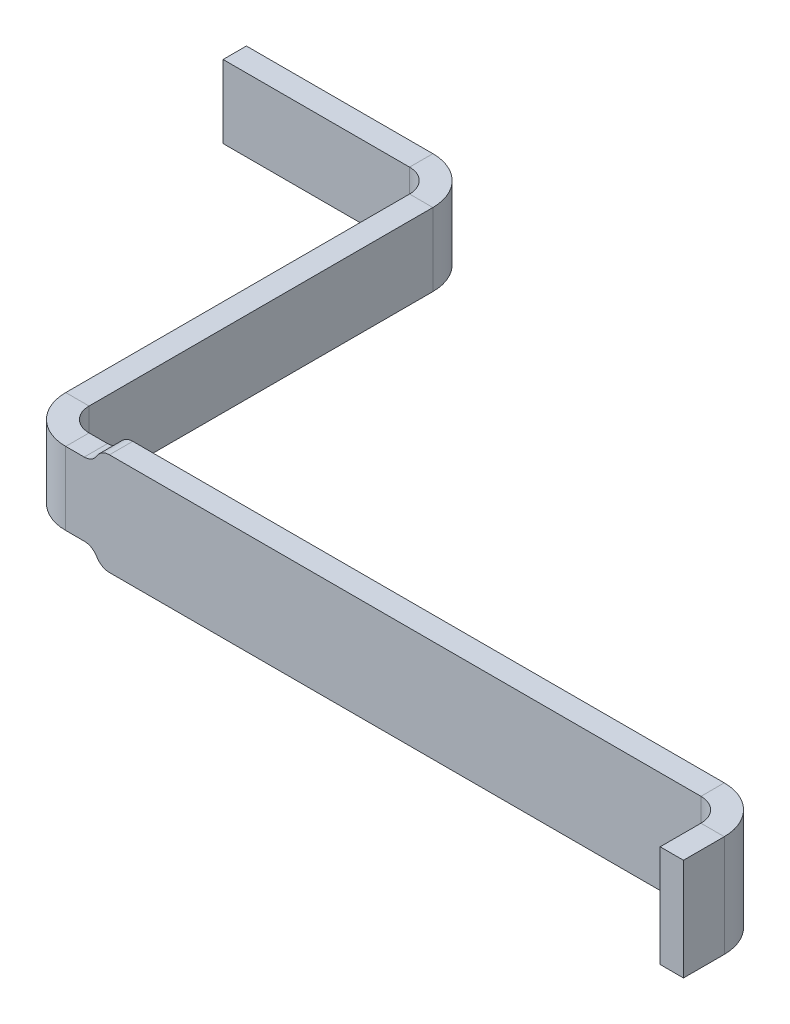
ISO-10303-21;
HEADER;
FILE_DESCRIPTION(('STEP AP214'),'2;1');
FILE_NAME('part.step','',(''),(''),'','','');
FILE_SCHEMA(('AUTOMOTIVE_DESIGN { 1 0 10303 214 1 1 1 1 }'));
ENDSEC;
DATA;
#1=APPLICATION_CONTEXT('core data for automotive mechanical design processes');
#2=APPLICATION_PROTOCOL_DEFINITION('international standard','automotive_design',2000,#1);
#3=PRODUCT_CONTEXT('',#1,'mechanical');
#4=PRODUCT('Part','Part','',(#3));
#5=PRODUCT_RELATED_PRODUCT_CATEGORY('part','',(#4));
#6=PRODUCT_DEFINITION_FORMATION('','',#4);
#7=PRODUCT_DEFINITION_CONTEXT('part definition',#1,'design');
#8=PRODUCT_DEFINITION('design','',#6,#7);
#9=PRODUCT_DEFINITION_SHAPE('','',#8);
#10=(LENGTH_UNIT() NAMED_UNIT(*) SI_UNIT(.MILLI.,.METRE.));
#11=(NAMED_UNIT(*) PLANE_ANGLE_UNIT() SI_UNIT($,.RADIAN.));
#12=(NAMED_UNIT(*) SI_UNIT($,.STERADIAN.) SOLID_ANGLE_UNIT());
#13=UNCERTAINTY_MEASURE_WITH_UNIT(LENGTH_MEASURE(1.E-05),#10,'distance_accuracy_value','');
#14=(GEOMETRIC_REPRESENTATION_CONTEXT(3) GLOBAL_UNCERTAINTY_ASSIGNED_CONTEXT((#13)) GLOBAL_UNIT_ASSIGNED_CONTEXT((#10,
#11,#12)) REPRESENTATION_CONTEXT('',''));
#15=CARTESIAN_POINT('',(0.,0.,0.));
#16=DIRECTION('',(0.,0.,1.));
#17=DIRECTION('',(1.,0.,0.));
#18=AXIS2_PLACEMENT_3D('',#15,#16,#17);
#19=CARTESIAN_POINT('',(0.05,0.,1.37));
#20=DIRECTION('',(0.,0.,-1.));
#21=DIRECTION('',(0.,-1.,0.));
#22=AXIS2_PLACEMENT_3D('',#19,#20,#21);
#23=PLANE('',#22);
#24=DIRECTION('',(-1.,0.,0.));
#25=VECTOR('',#24,1.);
#26=CARTESIAN_POINT('',(-0.463301270189222,0.125,1.37));
#27=LINE('',#26,#25);
#28=CARTESIAN_POINT('',(-0.976602540378444,0.125,1.37));
#29=VERTEX_POINT('',#28);
#30=CARTESIAN_POINT('',(-1.04,0.125,1.37));
#31=VERTEX_POINT('',#30);
#32=EDGE_CURVE('E474',#29,#31,#27,.T.);
#33=ORIENTED_EDGE('',*,*,#32,.T.);
#34=DIRECTION('',(0.,-1.,0.));
#35=VECTOR('',#34,1.);
#36=CARTESIAN_POINT('',(-1.04,-0.0875,1.37));
#37=LINE('',#36,#35);
#38=CARTESIAN_POINT('',(-1.04,-0.125,1.37));
#39=VERTEX_POINT('',#38);
#40=EDGE_CURVE('E319',#31,#39,#37,.T.);
#41=ORIENTED_EDGE('',*,*,#40,.T.);
#42=DIRECTION('',(1.,0.,0.));
#43=VECTOR('',#42,1.);
#44=CARTESIAN_POINT('',(-1.56836281798667,-0.125,1.37));
#45=LINE('',#44,#43);
#46=CARTESIAN_POINT('',(-0.976602540378444,-0.125,1.37));
#47=VERTEX_POINT('',#46);
#48=EDGE_CURVE('E393',#39,#47,#45,.T.);
#49=ORIENTED_EDGE('',*,*,#48,.T.);
#50=CARTESIAN_POINT('',(-0.976602540378444,-0.175,1.37));
#51=DIRECTION('',(0.,0.,-1.));
#52=DIRECTION('',(0.866025403784445,0.499999999999988,0.));
#53=AXIS2_PLACEMENT_3D('',#50,#51,#52);
#54=CIRCLE('',#53,0.05);
#55=CARTESIAN_POINT('',(-0.933301270189222,-0.15,1.37));
#56=VERTEX_POINT('',#55);
#57=EDGE_CURVE('E372',#47,#56,#54,.T.);
#58=ORIENTED_EDGE('',*,*,#57,.T.);
#59=CARTESIAN_POINT('',(-0.89,-0.125,1.37));
#60=DIRECTION('',(0.,0.,1.));
#61=DIRECTION('',(-0.86602540378444,-0.5,0.));
#62=AXIS2_PLACEMENT_3D('',#59,#60,#61);
#63=CIRCLE('',#62,0.05);
#64=CARTESIAN_POINT('',(-0.89,-0.175,1.37));
#65=VERTEX_POINT('',#64);
#66=EDGE_CURVE('E344',#56,#65,#63,.T.);
#67=ORIENTED_EDGE('',*,*,#66,.T.);
#68=DIRECTION('',(1.,0.,0.));
#69=VECTOR('',#68,1.);
#70=CARTESIAN_POINT('',(-1.2,-0.175,1.37));
#71=LINE('',#70,#69);
#72=CARTESIAN_POINT('',(1.14,-0.175,1.37));
#73=VERTEX_POINT('',#72);
#74=EDGE_CURVE('E11',#65,#73,#71,.T.);
#75=ORIENTED_EDGE('',*,*,#74,.T.);
#76=DIRECTION('',(0.,1.,0.));
#77=VECTOR('',#76,1.);
#78=CARTESIAN_POINT('',(1.14,-0.0875,1.37));
#79=LINE('',#78,#77);
#80=CARTESIAN_POINT('',(1.14,0.175,1.37));
#81=VERTEX_POINT('',#80);
#82=EDGE_CURVE('E27',#73,#81,#79,.T.);
#83=ORIENTED_EDGE('',*,*,#82,.T.);
#84=DIRECTION('',(-1.,0.,0.));
#85=VECTOR('',#84,1.);
#86=CARTESIAN_POINT('',(1.3,0.175,1.37));
#87=LINE('',#86,#85);
#88=CARTESIAN_POINT('',(-0.89,0.175,1.37));
#89=VERTEX_POINT('',#88);
#90=EDGE_CURVE('E375',#81,#89,#87,.T.);
#91=ORIENTED_EDGE('',*,*,#90,.T.);
#92=CARTESIAN_POINT('',(-0.89,0.125,1.37));
#93=DIRECTION('',(0.,0.,1.));
#94=DIRECTION('',(0.,1.,0.));
#95=AXIS2_PLACEMENT_3D('',#92,#93,#94);
#96=CIRCLE('',#95,0.05);
#97=CARTESIAN_POINT('',(-0.933301270189222,0.15,1.37));
#98=VERTEX_POINT('',#97);
#99=EDGE_CURVE('E295',#89,#98,#96,.T.);
#100=ORIENTED_EDGE('',*,*,#99,.T.);
#101=CARTESIAN_POINT('',(-0.976602540378444,0.175,1.37));
#102=DIRECTION('',(0.,0.,-1.));
#103=DIRECTION('',(0.,-1.,0.));
#104=AXIS2_PLACEMENT_3D('',#101,#102,#103);
#105=CIRCLE('',#104,0.05);
#106=EDGE_CURVE('E258',#98,#29,#105,.T.);
#107=ORIENTED_EDGE('',*,*,#106,.T.);
#108=EDGE_LOOP('',(#33,#41,#49,#58,#67,#75,#83,#91,#100,#107));
#109=FACE_BOUND('',#108,.T.);
#110=ADVANCED_FACE('F16',(#109),#23,.F.);
#111=CARTESIAN_POINT('',(1.3,-0.175,1.37));
#112=DIRECTION('',(0.,-1.,0.));
#113=DIRECTION('',(0.,0.,-1.));
#114=AXIS2_PLACEMENT_3D('',#111,#112,#113);
#115=PLANE('',#114);
#116=DIRECTION('',(0.,0.,1.));
#117=VECTOR('',#116,1.);
#118=CARTESIAN_POINT('',(-0.89,-0.175,1.37));
#119=LINE('',#118,#117);
#120=CARTESIAN_POINT('',(-0.89,-0.175,1.29));
#121=VERTEX_POINT('',#120);
#122=EDGE_CURVE('E340',#121,#65,#119,.T.);
#123=ORIENTED_EDGE('',*,*,#122,.F.);
#124=DIRECTION('',(-1.,0.,0.));
#125=VECTOR('',#124,1.);
#126=CARTESIAN_POINT('',(-1.2,-0.175,1.29));
#127=LINE('',#126,#125);
#128=CARTESIAN_POINT('',(1.14,-0.175,1.29));
#129=VERTEX_POINT('',#128);
#130=EDGE_CURVE('E218',#129,#121,#127,.T.);
#131=ORIENTED_EDGE('',*,*,#130,.F.);
#132=DIRECTION('',(0.,0.,1.));
#133=VECTOR('',#132,1.);
#134=CARTESIAN_POINT('',(1.14,-0.175,1.37));
#135=LINE('',#134,#133);
#136=EDGE_CURVE('E329',#129,#73,#135,.T.);
#137=ORIENTED_EDGE('',*,*,#136,.T.);
#138=ORIENTED_EDGE('',*,*,#74,.F.);
#139=EDGE_LOOP('',(#123,#131,#137,#138));
#140=FACE_BOUND('',#139,.T.);
#141=ADVANCED_FACE('F1066',(#140),#115,.T.);
#142=CARTESIAN_POINT('',(1.3,0.,0.196637182013331));
#143=DIRECTION('',(1.,0.,0.));
#144=DIRECTION('',(0.,0.,1.));
#145=AXIS2_PLACEMENT_3D('',#142,#143,#144);
#146=PLANE('',#145);
#147=DIRECTION('',(0.,1.,0.));
#148=VECTOR('',#147,1.);
#149=CARTESIAN_POINT('',(1.3,0.,1.45));
#150=LINE('',#149,#148);
#151=CARTESIAN_POINT('',(1.3,-0.175,1.45));
#152=VERTEX_POINT('',#151);
#153=CARTESIAN_POINT('',(1.3,0.175,1.45));
#154=VERTEX_POINT('',#153);
#155=EDGE_CURVE('E320',#152,#154,#150,.T.);
#156=ORIENTED_EDGE('',*,*,#155,.T.);
#157=DIRECTION('',(0.,0.,1.));
#158=VECTOR('',#157,1.);
#159=CARTESIAN_POINT('',(1.3,0.175,1.12327436402666));
#160=LINE('',#159,#158);
#161=CARTESIAN_POINT('',(1.3,0.175,1.59));
#162=VERTEX_POINT('',#161);
#163=EDGE_CURVE('E303',#154,#162,#160,.T.);
#164=ORIENTED_EDGE('',*,*,#163,.T.);
#165=DIRECTION('',(0.,-1.,0.));
#166=VECTOR('',#165,1.);
#167=CARTESIAN_POINT('',(1.3,-0.175,1.59));
#168=LINE('',#167,#166);
#169=CARTESIAN_POINT('',(1.3,-0.175,1.59));
#170=VERTEX_POINT('',#169);
#171=EDGE_CURVE('E41',#162,#170,#168,.T.);
#172=ORIENTED_EDGE('',*,*,#171,.T.);
#173=DIRECTION('',(0.,0.,-1.));
#174=VECTOR('',#173,1.);
#175=CARTESIAN_POINT('',(1.3,-0.175,1.45));
#176=LINE('',#175,#174);
#177=EDGE_CURVE('E328',#170,#152,#176,.T.);
#178=ORIENTED_EDGE('',*,*,#177,.T.);
#179=EDGE_LOOP('',(#156,#164,#172,#178));
#180=FACE_BOUND('',#179,.T.);
#181=ADVANCED_FACE('F532',(#180),#146,.T.);
#182=CARTESIAN_POINT('',(1.14,0.,1.45));
#183=DIRECTION('',(0.,-1.,0.));
#184=DIRECTION('',(0.,0.,-1.));
#185=AXIS2_PLACEMENT_3D('',#182,#183,#184);
#186=CYLINDRICAL_SURFACE('',#185,0.08);
#187=DIRECTION('',(0.,-1.,0.));
#188=VECTOR('',#187,1.);
#189=CARTESIAN_POINT('',(1.22,0.,1.45));
#190=LINE('',#189,#188);
#191=CARTESIAN_POINT('',(1.22,0.175,1.45));
#192=VERTEX_POINT('',#191);
#193=CARTESIAN_POINT('',(1.22,-0.175,1.45));
#194=VERTEX_POINT('',#193);
#195=EDGE_CURVE('E306',#192,#194,#190,.T.);
#196=ORIENTED_EDGE('',*,*,#195,.F.);
#197=CARTESIAN_POINT('',(1.14,0.175,1.45));
#198=DIRECTION('',(0.,1.,0.));
#199=DIRECTION('',(1.,0.,0.));
#200=AXIS2_PLACEMENT_3D('',#197,#198,#199);
#201=CIRCLE('',#200,0.08);
#202=EDGE_CURVE('E325',#192,#81,#201,.T.);
#203=ORIENTED_EDGE('',*,*,#202,.T.);
#204=ORIENTED_EDGE('',*,*,#82,.F.);
#205=CARTESIAN_POINT('',(1.14,-0.175,1.45));
#206=DIRECTION('',(0.,1.,0.));
#207=DIRECTION('',(1.,0.,0.));
#208=AXIS2_PLACEMENT_3D('',#205,#206,#207);
#209=CIRCLE('',#208,0.08);
#210=EDGE_CURVE('E379',#194,#73,#209,.T.);
#211=ORIENTED_EDGE('',*,*,#210,.F.);
#212=EDGE_LOOP('',(#196,#203,#204,#211));
#213=FACE_BOUND('',#212,.T.);
#214=ADVANCED_FACE('F18',(#213),#186,.F.);
#215=CARTESIAN_POINT('',(1.22,0.175,1.59));
#216=DIRECTION('',(0.,0.,1.));
#217=DIRECTION('',(1.,0.,0.));
#218=AXIS2_PLACEMENT_3D('',#215,#216,#217);
#219=PLANE('',#218);
#220=DIRECTION('',(0.,1.,0.));
#221=VECTOR('',#220,1.);
#222=CARTESIAN_POINT('',(1.22,-0.175,1.59));
#223=LINE('',#222,#221);
#224=CARTESIAN_POINT('',(1.22,-0.175,1.59));
#225=VERTEX_POINT('',#224);
#226=CARTESIAN_POINT('',(1.22,0.175,1.59));
#227=VERTEX_POINT('',#226);
#228=EDGE_CURVE('E386',#225,#227,#223,.T.);
#229=ORIENTED_EDGE('',*,*,#228,.F.);
#230=DIRECTION('',(1.,0.,0.));
#231=VECTOR('',#230,1.);
#232=CARTESIAN_POINT('',(1.22,-0.175,1.59));
#233=LINE('',#232,#231);
#234=EDGE_CURVE('E348',#225,#170,#233,.T.);
#235=ORIENTED_EDGE('',*,*,#234,.T.);
#236=ORIENTED_EDGE('',*,*,#171,.F.);
#237=DIRECTION('',(1.,0.,0.));
#238=VECTOR('',#237,1.);
#239=CARTESIAN_POINT('',(1.22,0.175,1.59));
#240=LINE('',#239,#238);
#241=EDGE_CURVE('E307',#227,#162,#240,.T.);
#242=ORIENTED_EDGE('',*,*,#241,.F.);
#243=EDGE_LOOP('',(#229,#235,#236,#242));
#244=FACE_BOUND('',#243,.T.);
#245=ADVANCED_FACE('F531',(#244),#219,.T.);
#246=CARTESIAN_POINT('',(1.22,-0.175,1.59));
#247=DIRECTION('',(0.,-1.,0.));
#248=DIRECTION('',(0.,0.,-1.));
#249=AXIS2_PLACEMENT_3D('',#246,#247,#248);
#250=PLANE('',#249);
#251=DIRECTION('',(1.,0.,0.));
#252=VECTOR('',#251,1.);
#253=CARTESIAN_POINT('',(1.232,-0.175,1.45));
#254=LINE('',#253,#252);
#255=EDGE_CURVE('E383',#194,#152,#254,.T.);
#256=ORIENTED_EDGE('',*,*,#255,.T.);
#257=ORIENTED_EDGE('',*,*,#177,.F.);
#258=ORIENTED_EDGE('',*,*,#234,.F.);
#259=DIRECTION('',(0.,0.,-1.));
#260=VECTOR('',#259,1.);
#261=CARTESIAN_POINT('',(1.22,-0.175,1.12327436402666));
#262=LINE('',#261,#260);
#263=EDGE_CURVE('E390',#225,#194,#262,.T.);
#264=ORIENTED_EDGE('',*,*,#263,.T.);
#265=EDGE_LOOP('',(#256,#257,#258,#264));
#266=FACE_BOUND('',#265,.T.);
#267=ADVANCED_FACE('F1033',(#266),#250,.T.);
#268=CARTESIAN_POINT('',(1.3,0.175,1.45));
#269=DIRECTION('',(0.,1.,0.));
#270=DIRECTION('',(1.,0.,0.));
#271=AXIS2_PLACEMENT_3D('',#268,#269,#270);
#272=PLANE('',#271);
#273=DIRECTION('',(-1.,0.,0.));
#274=VECTOR('',#273,1.);
#275=CARTESIAN_POINT('',(1.232,0.175,1.45));
#276=LINE('',#275,#274);
#277=EDGE_CURVE('E432',#154,#192,#276,.T.);
#278=ORIENTED_EDGE('',*,*,#277,.F.);
#279=CARTESIAN_POINT('',(1.14,0.175,1.45));
#280=DIRECTION('',(0.,-1.,0.));
#281=DIRECTION('',(0.,0.,-1.));
#282=AXIS2_PLACEMENT_3D('',#279,#280,#281);
#283=CIRCLE('',#282,0.16);
#284=CARTESIAN_POINT('',(1.14,0.175,1.29));
#285=VERTEX_POINT('',#284);
#286=EDGE_CURVE('E468',#285,#154,#283,.T.);
#287=ORIENTED_EDGE('',*,*,#286,.F.);
#288=DIRECTION('',(0.,0.,-1.));
#289=VECTOR('',#288,1.);
#290=CARTESIAN_POINT('',(1.14,0.175,1.37));
#291=LINE('',#290,#289);
#292=EDGE_CURVE('E402',#81,#285,#291,.T.);
#293=ORIENTED_EDGE('',*,*,#292,.F.);
#294=ORIENTED_EDGE('',*,*,#202,.F.);
#295=EDGE_LOOP('',(#278,#287,#293,#294));
#296=FACE_BOUND('',#295,.T.);
#297=ADVANCED_FACE('F520',(#296),#272,.T.);
#298=CARTESIAN_POINT('',(1.22,-0.175,1.45));
#299=DIRECTION('',(0.,-1.,0.));
#300=DIRECTION('',(0.,0.,-1.));
#301=AXIS2_PLACEMENT_3D('',#298,#299,#300);
#302=PLANE('',#301);
#303=ORIENTED_EDGE('',*,*,#255,.F.);
#304=ORIENTED_EDGE('',*,*,#210,.T.);
#305=ORIENTED_EDGE('',*,*,#136,.F.);
#306=CARTESIAN_POINT('',(1.14,-0.175,1.45));
#307=DIRECTION('',(0.,1.,0.));
#308=DIRECTION('',(1.,0.,0.));
#309=AXIS2_PLACEMENT_3D('',#306,#307,#308);
#310=CIRCLE('',#309,0.16);
#311=EDGE_CURVE('E324',#152,#129,#310,.T.);
#312=ORIENTED_EDGE('',*,*,#311,.F.);
#313=EDGE_LOOP('',(#303,#304,#305,#312));
#314=FACE_BOUND('',#313,.T.);
#315=ADVANCED_FACE('F1015',(#314),#302,.T.);
#316=CARTESIAN_POINT('',(1.22,0.,0.196637182013331));
#317=DIRECTION('',(1.,0.,0.));
#318=DIRECTION('',(0.,0.,1.));
#319=AXIS2_PLACEMENT_3D('',#316,#317,#318);
#320=PLANE('',#319);
#321=ORIENTED_EDGE('',*,*,#195,.T.);
#322=ORIENTED_EDGE('',*,*,#263,.F.);
#323=ORIENTED_EDGE('',*,*,#228,.T.);
#324=DIRECTION('',(0.,0.,-1.));
#325=VECTOR('',#324,1.);
#326=CARTESIAN_POINT('',(1.22,0.175,1.12327436402666));
#327=LINE('',#326,#325);
#328=EDGE_CURVE('E409',#227,#192,#327,.T.);
#329=ORIENTED_EDGE('',*,*,#328,.T.);
#330=EDGE_LOOP('',(#321,#322,#323,#329));
#331=FACE_BOUND('',#330,.T.);
#332=ADVANCED_FACE('F529',(#331),#320,.F.);
#333=CARTESIAN_POINT('',(1.22,0.175,1.28663718201333));
#334=DIRECTION('',(0.,1.,0.));
#335=DIRECTION('',(1.,0.,0.));
#336=AXIS2_PLACEMENT_3D('',#333,#334,#335);
#337=PLANE('',#336);
#338=ORIENTED_EDGE('',*,*,#277,.T.);
#339=ORIENTED_EDGE('',*,*,#328,.F.);
#340=ORIENTED_EDGE('',*,*,#241,.T.);
#341=ORIENTED_EDGE('',*,*,#163,.F.);
#342=EDGE_LOOP('',(#338,#339,#340,#341));
#343=FACE_BOUND('',#342,.T.);
#344=ADVANCED_FACE('F518',(#343),#337,.T.);
#345=CARTESIAN_POINT('',(1.14,0.,1.45));
#346=DIRECTION('',(0.,-1.,0.));
#347=DIRECTION('',(0.,0.,-1.));
#348=AXIS2_PLACEMENT_3D('',#345,#346,#347);
#349=CYLINDRICAL_SURFACE('',#348,0.16);
#350=ORIENTED_EDGE('',*,*,#155,.F.);
#351=ORIENTED_EDGE('',*,*,#311,.T.);
#352=DIRECTION('',(0.,-1.,0.));
#353=VECTOR('',#352,1.);
#354=CARTESIAN_POINT('',(1.14,-0.0875,1.29));
#355=LINE('',#354,#353);
#356=EDGE_CURVE('E347',#285,#129,#355,.T.);
#357=ORIENTED_EDGE('',*,*,#356,.F.);
#358=ORIENTED_EDGE('',*,*,#286,.T.);
#359=EDGE_LOOP('',(#350,#351,#357,#358));
#360=FACE_BOUND('',#359,.T.);
#361=ADVANCED_FACE('F533',(#360),#349,.T.);
#362=CARTESIAN_POINT('',(-1.04,0.,1.21));
#363=DIRECTION('',(0.,-1.,0.));
#364=DIRECTION('',(0.,0.,1.));
#365=AXIS2_PLACEMENT_3D('',#362,#363,#364);
#366=CYLINDRICAL_SURFACE('',#365,0.08);
#367=CARTESIAN_POINT('',(-1.04,0.125,1.21));
#368=DIRECTION('',(0.,1.,0.));
#369=DIRECTION('',(-1.,0.,0.));
#370=AXIS2_PLACEMENT_3D('',#367,#368,#369);
#371=CIRCLE('',#370,0.08);
#372=CARTESIAN_POINT('',(-1.12,0.125,1.21));
#373=VERTEX_POINT('',#372);
#374=CARTESIAN_POINT('',(-1.04,0.125,1.29));
#375=VERTEX_POINT('',#374);
#376=EDGE_CURVE('E233',#373,#375,#371,.T.);
#377=ORIENTED_EDGE('',*,*,#376,.T.);
#378=DIRECTION('',(0.,1.,0.));
#379=VECTOR('',#378,1.);
#380=CARTESIAN_POINT('',(-1.04,-0.0875,1.29));
#381=LINE('',#380,#379);
#382=CARTESIAN_POINT('',(-1.04,-0.125,1.29));
#383=VERTEX_POINT('',#382);
#384=EDGE_CURVE('E204',#383,#375,#381,.T.);
#385=ORIENTED_EDGE('',*,*,#384,.F.);
#386=CARTESIAN_POINT('',(-1.04,-0.125,1.21));
#387=DIRECTION('',(0.,-1.,0.));
#388=DIRECTION('',(0.,0.,1.));
#389=AXIS2_PLACEMENT_3D('',#386,#387,#388);
#390=CIRCLE('',#389,0.08);
#391=CARTESIAN_POINT('',(-1.12,-0.125,1.21));
#392=VERTEX_POINT('',#391);
#393=EDGE_CURVE('E241',#383,#392,#390,.T.);
#394=ORIENTED_EDGE('',*,*,#393,.T.);
#395=DIRECTION('',(0.,-1.,0.));
#396=VECTOR('',#395,1.);
#397=CARTESIAN_POINT('',(-1.12,0.,1.21));
#398=LINE('',#397,#396);
#399=EDGE_CURVE('E235',#373,#392,#398,.T.);
#400=ORIENTED_EDGE('',*,*,#399,.F.);
#401=EDGE_LOOP('',(#377,#385,#394,#400));
#402=FACE_BOUND('',#401,.T.);
#403=ADVANCED_FACE('F234',(#402),#366,.F.);
#404=CARTESIAN_POINT('',(-1.12,0.,2.46336281798667));
#405=DIRECTION('',(1.,0.,0.));
#406=DIRECTION('',(0.,0.,1.));
#407=AXIS2_PLACEMENT_3D('',#404,#405,#406);
#408=PLANE('',#407);
#409=DIRECTION('',(0.,0.,1.));
#410=VECTOR('',#409,1.);
#411=CARTESIAN_POINT('',(-1.12,0.125,1.95006154779745));
#412=LINE('',#411,#410);
#413=CARTESIAN_POINT('',(-1.12,0.125,0.0299999999999995));
#414=VERTEX_POINT('',#413);
#415=EDGE_CURVE('E316',#414,#373,#412,.T.);
#416=ORIENTED_EDGE('',*,*,#415,.T.);
#417=ORIENTED_EDGE('',*,*,#399,.T.);
#418=DIRECTION('',(0.,0.,-1.));
#419=VECTOR('',#418,1.);
#420=CARTESIAN_POINT('',(-1.12,-0.125,0.845));
#421=LINE('',#420,#419);
#422=CARTESIAN_POINT('',(-1.12,-0.125,0.0299999999999995));
#423=VERTEX_POINT('',#422);
#424=EDGE_CURVE('E277',#392,#423,#421,.T.);
#425=ORIENTED_EDGE('',*,*,#424,.T.);
#426=DIRECTION('',(0.,1.,0.));
#427=VECTOR('',#426,1.);
#428=CARTESIAN_POINT('',(-1.12,0.0875,0.0299999999999995));
#429=LINE('',#428,#427);
#430=EDGE_CURVE('E217',#423,#414,#429,.T.);
#431=ORIENTED_EDGE('',*,*,#430,.T.);
#432=EDGE_LOOP('',(#416,#417,#425,#431));
#433=FACE_BOUND('',#432,.T.);
#434=ADVANCED_FACE('F969',(#433),#408,.T.);
#435=CARTESIAN_POINT('',(1.31672563597334,0.,-0.129999999999998));
#436=DIRECTION('',(0.,0.,-1.));
#437=DIRECTION('',(0.,-1.,0.));
#438=AXIS2_PLACEMENT_3D('',#435,#436,#437);
#439=PLANE('',#438);
#440=DIRECTION('',(1.,0.,0.));
#441=VECTOR('',#440,1.);
#442=CARTESIAN_POINT('',(0.803424365784118,0.125,-0.13));
#443=LINE('',#442,#441);
#444=CARTESIAN_POINT('',(-1.92,0.125,-0.13));
#445=VERTEX_POINT('',#444);
#446=CARTESIAN_POINT('',(-1.28,0.125,-0.13));
#447=VERTEX_POINT('',#446);
#448=EDGE_CURVE('E256',#445,#447,#443,.T.);
#449=ORIENTED_EDGE('',*,*,#448,.T.);
#450=DIRECTION('',(0.,-1.,0.));
#451=VECTOR('',#450,1.);
#452=CARTESIAN_POINT('',(-1.28,0.,-0.13));
#453=LINE('',#452,#451);
#454=CARTESIAN_POINT('',(-1.28,-0.125,-0.13));
#455=VERTEX_POINT('',#454);
#456=EDGE_CURVE('E299',#447,#455,#453,.T.);
#457=ORIENTED_EDGE('',*,*,#456,.T.);
#458=DIRECTION('',(-1.,0.,0.));
#459=VECTOR('',#458,1.);
#460=CARTESIAN_POINT('',(-0.30163718201333,-0.125,-0.13));
#461=LINE('',#460,#459);
#462=CARTESIAN_POINT('',(-1.92,-0.125,-0.13));
#463=VERTEX_POINT('',#462);
#464=EDGE_CURVE('E368',#455,#463,#461,.T.);
#465=ORIENTED_EDGE('',*,*,#464,.T.);
#466=DIRECTION('',(0.,1.,0.));
#467=VECTOR('',#466,1.);
#468=CARTESIAN_POINT('',(-1.92,0.175,-0.13));
#469=LINE('',#468,#467);
#470=EDGE_CURVE('E302',#463,#445,#469,.T.);
#471=ORIENTED_EDGE('',*,*,#470,.T.);
#472=EDGE_LOOP('',(#449,#457,#465,#471));
#473=FACE_BOUND('',#472,.T.);
#474=ADVANCED_FACE('F578',(#473),#439,.T.);
#475=CARTESIAN_POINT('',(-1.92,-0.175,-0.0500000000000009));
#476=DIRECTION('',(-1.,0.,0.));
#477=DIRECTION('',(0.,0.,1.));
#478=AXIS2_PLACEMENT_3D('',#475,#476,#477);
#479=PLANE('',#478);
#480=DIRECTION('',(0.,0.,-1.));
#481=VECTOR('',#480,1.);
#482=CARTESIAN_POINT('',(-1.92,0.125,-0.0500000000000009));
#483=LINE('',#482,#481);
#484=CARTESIAN_POINT('',(-1.92,0.125,-0.0500000000000053));
#485=VERTEX_POINT('',#484);
#486=EDGE_CURVE('E278',#485,#445,#483,.T.);
#487=ORIENTED_EDGE('',*,*,#486,.T.);
#488=ORIENTED_EDGE('',*,*,#470,.F.);
#489=DIRECTION('',(0.,0.,1.));
#490=VECTOR('',#489,1.);
#491=CARTESIAN_POINT('',(-1.92,-0.125,-0.0500000000000031));
#492=LINE('',#491,#490);
#493=CARTESIAN_POINT('',(-1.92,-0.125,-0.0500000000000053));
#494=VERTEX_POINT('',#493);
#495=EDGE_CURVE('E268',#463,#494,#492,.T.);
#496=ORIENTED_EDGE('',*,*,#495,.T.);
#497=DIRECTION('',(0.,-1.,0.));
#498=VECTOR('',#497,1.);
#499=CARTESIAN_POINT('',(-1.92,0.175,-0.0500000000000009));
#500=LINE('',#499,#498);
#501=EDGE_CURVE('E272',#485,#494,#500,.T.);
#502=ORIENTED_EDGE('',*,*,#501,.F.);
#503=EDGE_LOOP('',(#487,#488,#496,#502));
#504=FACE_BOUND('',#503,.T.);
#505=ADVANCED_FACE('F948',(#504),#479,.T.);
#506=CARTESIAN_POINT('',(-1.28,0.,0.0299999999999992));
#507=DIRECTION('',(0.,1.,0.));
#508=DIRECTION('',(1.,0.,0.));
#509=AXIS2_PLACEMENT_3D('',#506,#507,#508);
#510=CYLINDRICAL_SURFACE('',#509,0.159999999999997);
#511=CARTESIAN_POINT('',(-1.28,0.125,0.0299999999999992));
#512=DIRECTION('',(0.,-1.,0.));
#513=DIRECTION('',(0.,0.,-1.));
#514=AXIS2_PLACEMENT_3D('',#511,#512,#513);
#515=CIRCLE('',#514,0.160000000000003);
#516=EDGE_CURVE('E436',#447,#414,#515,.T.);
#517=ORIENTED_EDGE('',*,*,#516,.T.);
#518=ORIENTED_EDGE('',*,*,#430,.F.);
#519=CARTESIAN_POINT('',(-1.28,-0.125,0.0299999999999992));
#520=DIRECTION('',(0.,1.,0.));
#521=DIRECTION('',(1.,0.,0.));
#522=AXIS2_PLACEMENT_3D('',#519,#520,#521);
#523=CIRCLE('',#522,0.160000000000003);
#524=EDGE_CURVE('E335',#423,#455,#523,.T.);
#525=ORIENTED_EDGE('',*,*,#524,.T.);
#526=ORIENTED_EDGE('',*,*,#456,.F.);
#527=EDGE_LOOP('',(#517,#518,#525,#526));
#528=FACE_BOUND('',#527,.T.);
#529=ADVANCED_FACE('F939',(#528),#510,.T.);
#530=CARTESIAN_POINT('',(0.05,0.,1.29));
#531=DIRECTION('',(0.,0.,-1.));
#532=DIRECTION('',(0.,-1.,0.));
#533=AXIS2_PLACEMENT_3D('',#530,#531,#532);
#534=PLANE('',#533);
#535=DIRECTION('',(1.,0.,0.));
#536=VECTOR('',#535,1.);
#537=CARTESIAN_POINT('',(-0.463301270189222,0.125,1.29));
#538=LINE('',#537,#536);
#539=CARTESIAN_POINT('',(-0.976602540378444,0.125,1.29));
#540=VERTEX_POINT('',#539);
#541=EDGE_CURVE('E208',#375,#540,#538,.T.);
#542=ORIENTED_EDGE('',*,*,#541,.T.);
#543=CARTESIAN_POINT('',(-0.976602540378444,0.175,1.29));
#544=DIRECTION('',(0.,0.,1.));
#545=DIRECTION('',(0.,-1.,0.));
#546=AXIS2_PLACEMENT_3D('',#543,#544,#545);
#547=CIRCLE('',#546,0.05);
#548=CARTESIAN_POINT('',(-0.933301270189222,0.15,1.29));
#549=VERTEX_POINT('',#548);
#550=EDGE_CURVE('E263',#540,#549,#547,.T.);
#551=ORIENTED_EDGE('',*,*,#550,.T.);
#552=CARTESIAN_POINT('',(-0.89,0.125,1.29));
#553=DIRECTION('',(0.,0.,-1.));
#554=DIRECTION('',(0.,1.,0.));
#555=AXIS2_PLACEMENT_3D('',#552,#553,#554);
#556=CIRCLE('',#555,0.05);
#557=CARTESIAN_POINT('',(-0.89,0.175,1.29));
#558=VERTEX_POINT('',#557);
#559=EDGE_CURVE('E291',#549,#558,#556,.T.);
#560=ORIENTED_EDGE('',*,*,#559,.T.);
#561=DIRECTION('',(1.,0.,0.));
#562=VECTOR('',#561,1.);
#563=CARTESIAN_POINT('',(1.3,0.175,1.29));
#564=LINE('',#563,#562);
#565=EDGE_CURVE('E311',#558,#285,#564,.T.);
#566=ORIENTED_EDGE('',*,*,#565,.T.);
#567=ORIENTED_EDGE('',*,*,#356,.T.);
#568=ORIENTED_EDGE('',*,*,#130,.T.);
#569=CARTESIAN_POINT('',(-0.89,-0.125,1.29));
#570=DIRECTION('',(0.,0.,-1.));
#571=DIRECTION('',(-0.86602540378444,-0.5,0.));
#572=AXIS2_PLACEMENT_3D('',#569,#570,#571);
#573=CIRCLE('',#572,0.05);
#574=CARTESIAN_POINT('',(-0.933301270189222,-0.15,1.29));
#575=VERTEX_POINT('',#574);
#576=EDGE_CURVE('E345',#121,#575,#573,.T.);
#577=ORIENTED_EDGE('',*,*,#576,.T.);
#578=CARTESIAN_POINT('',(-0.976602540378444,-0.175,1.29));
#579=DIRECTION('',(0.,0.,1.));
#580=DIRECTION('',(0.866025403784445,0.499999999999988,0.));
#581=AXIS2_PLACEMENT_3D('',#578,#579,#580);
#582=CIRCLE('',#581,0.05);
#583=CARTESIAN_POINT('',(-0.976602540378444,-0.125,1.29));
#584=VERTEX_POINT('',#583);
#585=EDGE_CURVE('E20',#575,#584,#582,.T.);
#586=ORIENTED_EDGE('',*,*,#585,.T.);
#587=DIRECTION('',(-1.,0.,0.));
#588=VECTOR('',#587,1.);
#589=CARTESIAN_POINT('',(-1.56836281798667,-0.125,1.29));
#590=LINE('',#589,#588);
#591=EDGE_CURVE('E211',#584,#383,#590,.T.);
#592=ORIENTED_EDGE('',*,*,#591,.T.);
#593=ORIENTED_EDGE('',*,*,#384,.T.);
#594=EDGE_LOOP('',(#542,#551,#560,#566,#567,#568,#577,#586,#592,#593));
#595=FACE_BOUND('',#594,.T.);
#596=ADVANCED_FACE('F206',(#595),#534,.T.);
#597=CARTESIAN_POINT('',(-1.04,0.,1.21));
#598=DIRECTION('',(0.,-1.,0.));
#599=DIRECTION('',(0.,0.,1.));
#600=AXIS2_PLACEMENT_3D('',#597,#598,#599);
#601=CYLINDRICAL_SURFACE('',#600,0.16);
#602=CARTESIAN_POINT('',(-1.04,0.125,1.21));
#603=DIRECTION('',(0.,-1.,0.));
#604=DIRECTION('',(0.,0.,1.));
#605=AXIS2_PLACEMENT_3D('',#602,#603,#604);
#606=CIRCLE('',#605,0.16);
#607=CARTESIAN_POINT('',(-1.2,0.125,1.21));
#608=VERTEX_POINT('',#607);
#609=EDGE_CURVE('E245',#31,#608,#606,.T.);
#610=ORIENTED_EDGE('',*,*,#609,.T.);
#611=DIRECTION('',(0.,1.,0.));
#612=VECTOR('',#611,1.);
#613=CARTESIAN_POINT('',(-1.2,0.,1.21));
#614=LINE('',#613,#612);
#615=CARTESIAN_POINT('',(-1.2,-0.125,1.21));
#616=VERTEX_POINT('',#615);
#617=EDGE_CURVE('E273',#616,#608,#614,.T.);
#618=ORIENTED_EDGE('',*,*,#617,.F.);
#619=CARTESIAN_POINT('',(-1.04,-0.125,1.21));
#620=DIRECTION('',(0.,1.,0.));
#621=DIRECTION('',(-1.,0.,0.));
#622=AXIS2_PLACEMENT_3D('',#619,#620,#621);
#623=CIRCLE('',#622,0.16);
#624=EDGE_CURVE('E471',#616,#39,#623,.T.);
#625=ORIENTED_EDGE('',*,*,#624,.T.);
#626=ORIENTED_EDGE('',*,*,#40,.F.);
#627=EDGE_LOOP('',(#610,#618,#625,#626));
#628=FACE_BOUND('',#627,.T.);
#629=ADVANCED_FACE('F923',(#628),#601,.T.);
#630=CARTESIAN_POINT('',(1.31672563597334,0.,-0.0499999999999978));
#631=DIRECTION('',(0.,0.,-1.));
#632=DIRECTION('',(0.,-1.,0.));
#633=AXIS2_PLACEMENT_3D('',#630,#631,#632);
#634=PLANE('',#633);
#635=DIRECTION('',(-1.,0.,0.));
#636=VECTOR('',#635,1.);
#637=CARTESIAN_POINT('',(0.803424365784117,0.125,-0.0499999999999989));
#638=LINE('',#637,#636);
#639=CARTESIAN_POINT('',(-1.28,0.125,-0.0500000000000009));
#640=VERTEX_POINT('',#639);
#641=EDGE_CURVE('E282',#640,#485,#638,.T.);
#642=ORIENTED_EDGE('',*,*,#641,.T.);
#643=ORIENTED_EDGE('',*,*,#501,.T.);
#644=DIRECTION('',(1.,0.,0.));
#645=VECTOR('',#644,1.);
#646=CARTESIAN_POINT('',(-0.30163718201333,-0.125,-0.0500000000000014));
#647=LINE('',#646,#645);
#648=CARTESIAN_POINT('',(-1.28,-0.125,-0.0500000000000009));
#649=VERTEX_POINT('',#648);
#650=EDGE_CURVE('E264',#494,#649,#647,.T.);
#651=ORIENTED_EDGE('',*,*,#650,.T.);
#652=DIRECTION('',(0.,1.,0.));
#653=VECTOR('',#652,1.);
#654=CARTESIAN_POINT('',(-1.28,0.,-0.0500000000000009));
#655=LINE('',#654,#653);
#656=EDGE_CURVE('E270',#649,#640,#655,.T.);
#657=ORIENTED_EDGE('',*,*,#656,.T.);
#658=EDGE_LOOP('',(#642,#643,#651,#657));
#659=FACE_BOUND('',#658,.T.);
#660=ADVANCED_FACE('F913',(#659),#634,.F.);
#661=CARTESIAN_POINT('',(-1.28,0.,0.0299999999999992));
#662=DIRECTION('',(0.,1.,0.));
#663=DIRECTION('',(1.,0.,0.));
#664=AXIS2_PLACEMENT_3D('',#661,#662,#663);
#665=CYLINDRICAL_SURFACE('',#664,0.0799999999999972);
#666=CARTESIAN_POINT('',(-1.28,0.125,0.0299999999999992));
#667=DIRECTION('',(0.,1.,0.));
#668=DIRECTION('',(1.,0.,0.));
#669=AXIS2_PLACEMENT_3D('',#666,#667,#668);
#670=CIRCLE('',#669,0.0800000000000026);
#671=CARTESIAN_POINT('',(-1.2,0.125,0.0299999999999995));
#672=VERTEX_POINT('',#671);
#673=EDGE_CURVE('E451',#672,#640,#670,.T.);
#674=ORIENTED_EDGE('',*,*,#673,.T.);
#675=ORIENTED_EDGE('',*,*,#656,.F.);
#676=CARTESIAN_POINT('',(-1.28,-0.125,0.0299999999999992));
#677=DIRECTION('',(0.,-1.,0.));
#678=DIRECTION('',(0.,0.,-1.));
#679=AXIS2_PLACEMENT_3D('',#676,#677,#678);
#680=CIRCLE('',#679,0.0800000000000028);
#681=CARTESIAN_POINT('',(-1.2,-0.125,0.0299999999999995));
#682=VERTEX_POINT('',#681);
#683=EDGE_CURVE('E422',#649,#682,#680,.T.);
#684=ORIENTED_EDGE('',*,*,#683,.T.);
#685=DIRECTION('',(0.,-1.,0.));
#686=VECTOR('',#685,1.);
#687=CARTESIAN_POINT('',(-1.2,0.0875,0.0299999999999995));
#688=LINE('',#687,#686);
#689=EDGE_CURVE('E308',#672,#682,#688,.T.);
#690=ORIENTED_EDGE('',*,*,#689,.F.);
#691=EDGE_LOOP('',(#674,#675,#684,#690));
#692=FACE_BOUND('',#691,.T.);
#693=ADVANCED_FACE('F564',(#692),#665,.F.);
#694=CARTESIAN_POINT('',(-1.2,0.,2.46336281798667));
#695=DIRECTION('',(1.,0.,0.));
#696=DIRECTION('',(0.,0.,1.));
#697=AXIS2_PLACEMENT_3D('',#694,#695,#696);
#698=PLANE('',#697);
#699=DIRECTION('',(0.,0.,-1.));
#700=VECTOR('',#699,1.);
#701=CARTESIAN_POINT('',(-1.2,0.125,1.95006154779745));
#702=LINE('',#701,#700);
#703=EDGE_CURVE('E312',#608,#672,#702,.T.);
#704=ORIENTED_EDGE('',*,*,#703,.T.);
#705=ORIENTED_EDGE('',*,*,#689,.T.);
#706=DIRECTION('',(0.,0.,1.));
#707=VECTOR('',#706,1.);
#708=CARTESIAN_POINT('',(-1.2,-0.125,0.845));
#709=LINE('',#708,#707);
#710=EDGE_CURVE('E287',#682,#616,#709,.T.);
#711=ORIENTED_EDGE('',*,*,#710,.T.);
#712=ORIENTED_EDGE('',*,*,#617,.T.);
#713=EDGE_LOOP('',(#704,#705,#711,#712));
#714=FACE_BOUND('',#713,.T.);
#715=ADVANCED_FACE('F894',(#714),#698,.F.);
#716=CARTESIAN_POINT('',(-1.2,0.175,1.37));
#717=DIRECTION('',(0.,1.,0.));
#718=DIRECTION('',(1.,0.,0.));
#719=AXIS2_PLACEMENT_3D('',#716,#717,#718);
#720=PLANE('',#719);
#721=DIRECTION('',(0.,0.,1.));
#722=VECTOR('',#721,1.);
#723=CARTESIAN_POINT('',(-0.89,0.175,1.37));
#724=LINE('',#723,#722);
#725=EDGE_CURVE('E269',#558,#89,#724,.T.);
#726=ORIENTED_EDGE('',*,*,#725,.T.);
#727=ORIENTED_EDGE('',*,*,#90,.F.);
#728=ORIENTED_EDGE('',*,*,#292,.T.);
#729=ORIENTED_EDGE('',*,*,#565,.F.);
#730=EDGE_LOOP('',(#726,#727,#728,#729));
#731=FACE_BOUND('',#730,.T.);
#732=ADVANCED_FACE('F884',(#731),#720,.T.);
#733=CARTESIAN_POINT('',(-0.976602540378444,-0.175,1.37));
#734=DIRECTION('',(0.,0.,-1.));
#735=DIRECTION('',(0.866025403784446,0.499999999999988,0.));
#736=AXIS2_PLACEMENT_3D('',#733,#734,#735);
#737=CYLINDRICAL_SURFACE('',#736,0.05);
#738=ORIENTED_EDGE('',*,*,#585,.F.);
#739=DIRECTION('',(0.,0.,-1.));
#740=VECTOR('',#739,1.);
#741=CARTESIAN_POINT('',(-0.933301270189222,-0.15,1.37));
#742=LINE('',#741,#740);
#743=EDGE_CURVE('E366',#56,#575,#742,.T.);
#744=ORIENTED_EDGE('',*,*,#743,.F.);
#745=ORIENTED_EDGE('',*,*,#57,.F.);
#746=DIRECTION('',(0.,0.,-1.));
#747=VECTOR('',#746,1.);
#748=CARTESIAN_POINT('',(-0.976602540378444,-0.125,1.37));
#749=LINE('',#748,#747);
#750=EDGE_CURVE('E412',#47,#584,#749,.T.);
#751=ORIENTED_EDGE('',*,*,#750,.T.);
#752=EDGE_LOOP('',(#738,#744,#745,#751));
#753=FACE_BOUND('',#752,.T.);
#754=ADVANCED_FACE('F873',(#753),#737,.F.);
#755=CARTESIAN_POINT('',(-0.89,-0.125,1.37));
#756=DIRECTION('',(0.,0.,-1.));
#757=DIRECTION('',(-0.86602540378444,-0.5,0.));
#758=AXIS2_PLACEMENT_3D('',#755,#756,#757);
#759=CYLINDRICAL_SURFACE('',#758,0.05);
#760=ORIENTED_EDGE('',*,*,#576,.F.);
#761=ORIENTED_EDGE('',*,*,#122,.T.);
#762=ORIENTED_EDGE('',*,*,#66,.F.);
#763=ORIENTED_EDGE('',*,*,#743,.T.);
#764=EDGE_LOOP('',(#760,#761,#762,#763));
#765=FACE_BOUND('',#764,.T.);
#766=ADVANCED_FACE('F862',(#765),#759,.T.);
#767=CARTESIAN_POINT('',(-1.92,-0.125,-0.0500000000000053));
#768=DIRECTION('',(0.,1.,0.));
#769=DIRECTION('',(1.,0.,0.));
#770=AXIS2_PLACEMENT_3D('',#767,#768,#769);
#771=PLANE('',#770);
#772=DIRECTION('',(0.,0.,1.));
#773=VECTOR('',#772,1.);
#774=CARTESIAN_POINT('',(-1.28,-0.125,-0.0500000000000031));
#775=LINE('',#774,#773);
#776=EDGE_CURVE('E331',#455,#649,#775,.T.);
#777=ORIENTED_EDGE('',*,*,#776,.T.);
#778=ORIENTED_EDGE('',*,*,#650,.F.);
#779=ORIENTED_EDGE('',*,*,#495,.F.);
#780=ORIENTED_EDGE('',*,*,#464,.F.);
#781=EDGE_LOOP('',(#777,#778,#779,#780));
#782=FACE_BOUND('',#781,.T.);
#783=ADVANCED_FACE('F851',(#782),#771,.F.);
#784=CARTESIAN_POINT('',(-0.89,0.125,1.37));
#785=DIRECTION('',(0.,0.,-1.));
#786=DIRECTION('',(0.,1.,0.));
#787=AXIS2_PLACEMENT_3D('',#784,#785,#786);
#788=CYLINDRICAL_SURFACE('',#787,0.05);
#789=ORIENTED_EDGE('',*,*,#559,.F.);
#790=DIRECTION('',(0.,0.,-1.));
#791=VECTOR('',#790,1.);
#792=CARTESIAN_POINT('',(-0.933301270189222,0.15,1.37));
#793=LINE('',#792,#791);
#794=EDGE_CURVE('E262',#98,#549,#793,.T.);
#795=ORIENTED_EDGE('',*,*,#794,.F.);
#796=ORIENTED_EDGE('',*,*,#99,.F.);
#797=ORIENTED_EDGE('',*,*,#725,.F.);
#798=EDGE_LOOP('',(#789,#795,#796,#797));
#799=FACE_BOUND('',#798,.T.);
#800=ADVANCED_FACE('F841',(#799),#788,.T.);
#801=CARTESIAN_POINT('',(-0.976602540378444,0.175,1.37));
#802=DIRECTION('',(0.,0.,-1.));
#803=DIRECTION('',(0.,-1.,0.));
#804=AXIS2_PLACEMENT_3D('',#801,#802,#803);
#805=CYLINDRICAL_SURFACE('',#804,0.05);
#806=ORIENTED_EDGE('',*,*,#550,.F.);
#807=DIRECTION('',(0.,0.,-1.));
#808=VECTOR('',#807,1.);
#809=CARTESIAN_POINT('',(-0.976602540378444,0.125,1.37));
#810=LINE('',#809,#808);
#811=EDGE_CURVE('E228',#29,#540,#810,.T.);
#812=ORIENTED_EDGE('',*,*,#811,.F.);
#813=ORIENTED_EDGE('',*,*,#106,.F.);
#814=ORIENTED_EDGE('',*,*,#794,.T.);
#815=EDGE_LOOP('',(#806,#812,#813,#814));
#816=FACE_BOUND('',#815,.T.);
#817=ADVANCED_FACE('F548',(#816),#805,.F.);
#818=CARTESIAN_POINT('',(-1.2,0.125,1.43676027760822));
#819=DIRECTION('',(0.,-1.,0.));
#820=DIRECTION('',(0.,0.,-1.));
#821=AXIS2_PLACEMENT_3D('',#818,#819,#820);
#822=PLANE('',#821);
#823=DIRECTION('',(1.,0.,0.));
#824=VECTOR('',#823,1.);
#825=CARTESIAN_POINT('',(-1.2,0.125,1.21));
#826=LINE('',#825,#824);
#827=EDGE_CURVE('E252',#608,#373,#826,.T.);
#828=ORIENTED_EDGE('',*,*,#827,.T.);
#829=ORIENTED_EDGE('',*,*,#415,.F.);
#830=DIRECTION('',(1.,0.,0.));
#831=VECTOR('',#830,1.);
#832=CARTESIAN_POINT('',(-1.2,0.125,0.0299999999999995));
#833=LINE('',#832,#831);
#834=EDGE_CURVE('E440',#672,#414,#833,.T.);
#835=ORIENTED_EDGE('',*,*,#834,.F.);
#836=ORIENTED_EDGE('',*,*,#703,.F.);
#837=EDGE_LOOP('',(#828,#829,#835,#836));
#838=FACE_BOUND('',#837,.T.);
#839=ADVANCED_FACE('F817',(#838),#822,.F.);
#840=CARTESIAN_POINT('',(-3.18672563597334,-0.125,1.37));
#841=DIRECTION('',(0.,1.,0.));
#842=DIRECTION('',(1.,0.,0.));
#843=AXIS2_PLACEMENT_3D('',#840,#841,#842);
#844=PLANE('',#843);
#845=DIRECTION('',(0.,0.,1.));
#846=VECTOR('',#845,1.);
#847=CARTESIAN_POINT('',(-1.04,-0.125,1.37));
#848=LINE('',#847,#846);
#849=EDGE_CURVE('E298',#383,#39,#848,.T.);
#850=ORIENTED_EDGE('',*,*,#849,.F.);
#851=ORIENTED_EDGE('',*,*,#591,.F.);
#852=ORIENTED_EDGE('',*,*,#750,.F.);
#853=ORIENTED_EDGE('',*,*,#48,.F.);
#854=EDGE_LOOP('',(#850,#851,#852,#853));
#855=FACE_BOUND('',#854,.T.);
#856=ADVANCED_FACE('F806',(#855),#844,.F.);
#857=CARTESIAN_POINT('',(-1.28,0.125,-0.0500000000000009));
#858=DIRECTION('',(0.,-1.,0.));
#859=DIRECTION('',(0.,0.,-1.));
#860=AXIS2_PLACEMENT_3D('',#857,#858,#859);
#861=PLANE('',#860);
#862=DIRECTION('',(0.,0.,-1.));
#863=VECTOR('',#862,1.);
#864=CARTESIAN_POINT('',(-1.28,0.125,-0.0500000000000006));
#865=LINE('',#864,#863);
#866=EDGE_CURVE('E230',#640,#447,#865,.T.);
#867=ORIENTED_EDGE('',*,*,#866,.F.);
#868=ORIENTED_EDGE('',*,*,#673,.F.);
#869=ORIENTED_EDGE('',*,*,#834,.T.);
#870=ORIENTED_EDGE('',*,*,#516,.F.);
#871=EDGE_LOOP('',(#867,#868,#869,#870));
#872=FACE_BOUND('',#871,.T.);
#873=ADVANCED_FACE('F573',(#872),#861,.F.);
#874=CARTESIAN_POINT('',(-1.28,-0.125,-0.13));
#875=DIRECTION('',(0.,1.,0.));
#876=DIRECTION('',(1.,0.,0.));
#877=AXIS2_PLACEMENT_3D('',#874,#875,#876);
#878=PLANE('',#877);
#879=ORIENTED_EDGE('',*,*,#776,.F.);
#880=ORIENTED_EDGE('',*,*,#524,.F.);
#881=DIRECTION('',(-1.,0.,0.));
#882=VECTOR('',#881,1.);
#883=CARTESIAN_POINT('',(-1.2,-0.125,0.0299999999999992));
#884=LINE('',#883,#882);
#885=EDGE_CURVE('E339',#423,#682,#884,.T.);
#886=ORIENTED_EDGE('',*,*,#885,.T.);
#887=ORIENTED_EDGE('',*,*,#683,.F.);
#888=EDGE_LOOP('',(#879,#880,#886,#887));
#889=FACE_BOUND('',#888,.T.);
#890=ADVANCED_FACE('F785',(#889),#878,.F.);
#891=CARTESIAN_POINT('',(0.290123095594896,0.125,-0.05));
#892=DIRECTION('',(0.,-1.,0.));
#893=DIRECTION('',(-1.,0.,0.));
#894=AXIS2_PLACEMENT_3D('',#891,#892,#893);
#895=PLANE('',#894);
#896=ORIENTED_EDGE('',*,*,#866,.T.);
#897=ORIENTED_EDGE('',*,*,#448,.F.);
#898=ORIENTED_EDGE('',*,*,#486,.F.);
#899=ORIENTED_EDGE('',*,*,#641,.F.);
#900=EDGE_LOOP('',(#896,#897,#898,#899));
#901=FACE_BOUND('',#900,.T.);
#902=ADVANCED_FACE('F569',(#901),#895,.F.);
#903=CARTESIAN_POINT('',(-0.976602540378444,0.125,1.37));
#904=DIRECTION('',(0.,-1.,0.));
#905=DIRECTION('',(-1.,0.,0.));
#906=AXIS2_PLACEMENT_3D('',#903,#904,#905);
#907=PLANE('',#906);
#908=DIRECTION('',(0.,0.,-1.));
#909=VECTOR('',#908,1.);
#910=CARTESIAN_POINT('',(-1.04,0.125,1.37));
#911=LINE('',#910,#909);
#912=EDGE_CURVE('E225',#31,#375,#911,.T.);
#913=ORIENTED_EDGE('',*,*,#912,.F.);
#914=ORIENTED_EDGE('',*,*,#32,.F.);
#915=ORIENTED_EDGE('',*,*,#811,.T.);
#916=ORIENTED_EDGE('',*,*,#541,.F.);
#917=EDGE_LOOP('',(#913,#914,#915,#916));
#918=FACE_BOUND('',#917,.T.);
#919=ADVANCED_FACE('F222',(#918),#907,.F.);
#920=CARTESIAN_POINT('',(-1.12,-0.125,1.21));
#921=DIRECTION('',(0.,1.,0.));
#922=DIRECTION('',(1.,0.,0.));
#923=AXIS2_PLACEMENT_3D('',#920,#921,#922);
#924=PLANE('',#923);
#925=DIRECTION('',(-1.,0.,0.));
#926=VECTOR('',#925,1.);
#927=CARTESIAN_POINT('',(-1.2,-0.125,1.21));
#928=LINE('',#927,#926);
#929=EDGE_CURVE('E283',#392,#616,#928,.T.);
#930=ORIENTED_EDGE('',*,*,#929,.F.);
#931=ORIENTED_EDGE('',*,*,#393,.F.);
#932=ORIENTED_EDGE('',*,*,#849,.T.);
#933=ORIENTED_EDGE('',*,*,#624,.F.);
#934=EDGE_LOOP('',(#930,#931,#932,#933));
#935=FACE_BOUND('',#934,.T.);
#936=ADVANCED_FACE('F752',(#935),#924,.F.);
#937=CARTESIAN_POINT('',(-1.2,0.125,1.21));
#938=DIRECTION('',(0.,-1.,0.));
#939=DIRECTION('',(0.,0.,-1.));
#940=AXIS2_PLACEMENT_3D('',#937,#938,#939);
#941=PLANE('',#940);
#942=ORIENTED_EDGE('',*,*,#827,.F.);
#943=ORIENTED_EDGE('',*,*,#609,.F.);
#944=ORIENTED_EDGE('',*,*,#912,.T.);
#945=ORIENTED_EDGE('',*,*,#376,.F.);
#946=EDGE_LOOP('',(#942,#943,#944,#945));
#947=FACE_BOUND('',#946,.T.);
#948=ADVANCED_FACE('F243',(#947),#941,.F.);
#949=CARTESIAN_POINT('',(-1.2,-0.125,-0.77336281798667));
#950=DIRECTION('',(0.,1.,0.));
#951=DIRECTION('',(0.,0.,-1.));
#952=AXIS2_PLACEMENT_3D('',#949,#950,#951);
#953=PLANE('',#952);
#954=ORIENTED_EDGE('',*,*,#929,.T.);
#955=ORIENTED_EDGE('',*,*,#710,.F.);
#956=ORIENTED_EDGE('',*,*,#885,.F.);
#957=ORIENTED_EDGE('',*,*,#424,.F.);
#958=EDGE_LOOP('',(#954,#955,#956,#957));
#959=FACE_BOUND('',#958,.T.);
#960=ADVANCED_FACE('F733',(#959),#953,.F.);
#961=CLOSED_SHELL('',(#110,#141,#181,#214,#245,#267,#297,#315,#332,#344,#361,#403,#434,#474,
#505,#529,#596,#629,#660,#693,#715,#732,#754,#766,#783,#800,#817,#839,#856,#873,#890,#902,#919,
#936,#948,#960));
#962=MANIFOLD_SOLID_BREP('B1',#961);
#963=ADVANCED_BREP_SHAPE_REPRESENTATION('',(#18,#962),#14);
#964=SHAPE_DEFINITION_REPRESENTATION(#9,#963);
ENDSEC;
END-ISO-10303-21;
